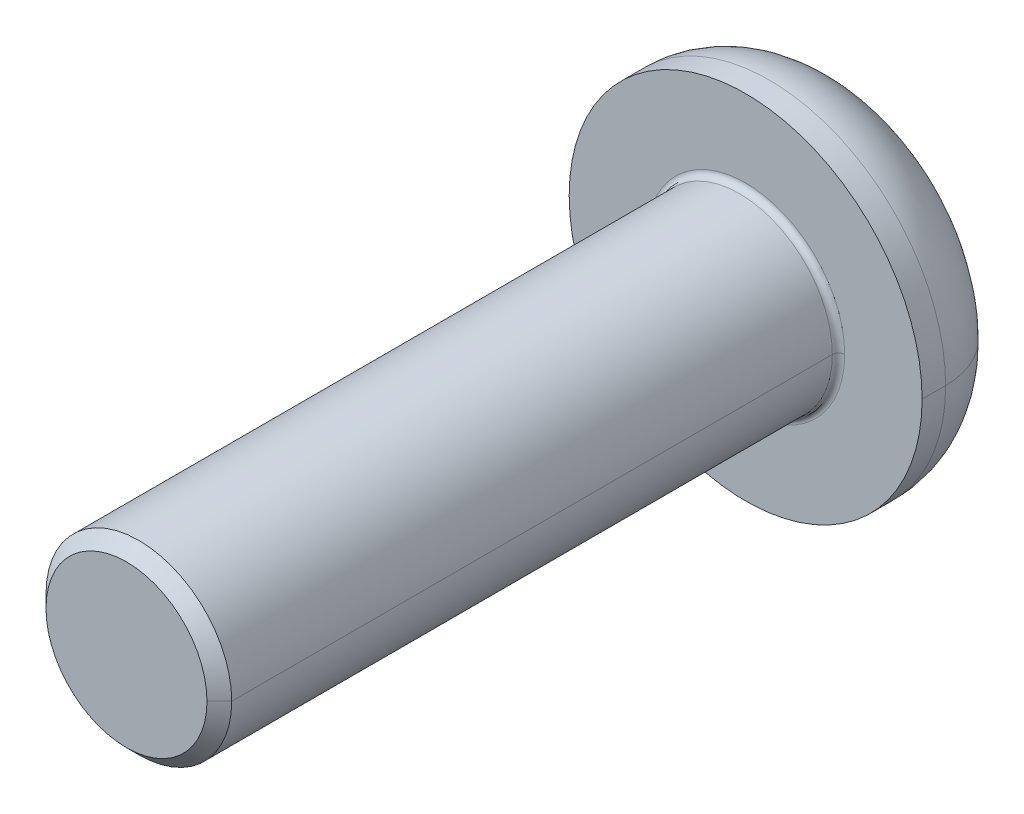
ISO-10303-21;
HEADER;
FILE_DESCRIPTION(('STEP AP214'),'2;1');
FILE_NAME('part.step','',(''),(''),'','','');
FILE_SCHEMA(('AUTOMOTIVE_DESIGN { 1 0 10303 214 1 1 1 1 }'));
ENDSEC;
DATA;
#1=APPLICATION_CONTEXT('core data for automotive mechanical design processes');
#2=APPLICATION_PROTOCOL_DEFINITION('international standard','automotive_design',2000,#1);
#3=PRODUCT_CONTEXT('',#1,'mechanical');
#4=PRODUCT('Part','Part','',(#3));
#5=PRODUCT_RELATED_PRODUCT_CATEGORY('part','',(#4));
#6=PRODUCT_DEFINITION_FORMATION('','',#4);
#7=PRODUCT_DEFINITION_CONTEXT('part definition',#1,'design');
#8=PRODUCT_DEFINITION('design','',#6,#7);
#9=PRODUCT_DEFINITION_SHAPE('','',#8);
#10=(LENGTH_UNIT() NAMED_UNIT(*) SI_UNIT(.MILLI.,.METRE.));
#11=(NAMED_UNIT(*) PLANE_ANGLE_UNIT() SI_UNIT($,.RADIAN.));
#12=(NAMED_UNIT(*) SI_UNIT($,.STERADIAN.) SOLID_ANGLE_UNIT());
#13=UNCERTAINTY_MEASURE_WITH_UNIT(LENGTH_MEASURE(1.E-05),#10,'distance_accuracy_value','');
#14=(GEOMETRIC_REPRESENTATION_CONTEXT(3) GLOBAL_UNCERTAINTY_ASSIGNED_CONTEXT((#13)) GLOBAL_UNIT_ASSIGNED_CONTEXT((#10,
#11,#12)) REPRESENTATION_CONTEXT('',''));
#15=CARTESIAN_POINT('',(0.,0.,0.));
#16=DIRECTION('',(0.,0.,1.));
#17=DIRECTION('',(1.,0.,0.));
#18=AXIS2_PLACEMENT_3D('',#15,#16,#17);
#19=CARTESIAN_POINT('',(0.,0.,0.1));
#20=DIRECTION('',(0.,0.,-1.));
#21=DIRECTION('',(-1.,0.,0.));
#22=AXIS2_PLACEMENT_3D('',#19,#20,#21);
#23=TOROIDAL_SURFACE('',#22,1.6,0.1);
#24=CARTESIAN_POINT('',(1.6,0.,0.1));
#25=DIRECTION('',(0.,1.,0.));
#26=DIRECTION('',(-1.,0.,0.));
#27=AXIS2_PLACEMENT_3D('',#24,#25,#26);
#28=CIRCLE('',#27,0.1);
#29=CARTESIAN_POINT('',(1.6,0.,0.));
#30=VERTEX_POINT('',#29);
#31=CARTESIAN_POINT('',(1.5,0.,0.1));
#32=VERTEX_POINT('',#31);
#33=EDGE_CURVE('E461',#30,#32,#28,.T.);
#34=ORIENTED_EDGE('',*,*,#33,.F.);
#35=CARTESIAN_POINT('',(0.,0.,0.));
#36=DIRECTION('',(0.,0.,-1.));
#37=DIRECTION('',(-1.,0.,0.));
#38=AXIS2_PLACEMENT_3D('',#35,#36,#37);
#39=CIRCLE('',#38,1.6);
#40=CARTESIAN_POINT('',(-1.6,0.,0.));
#41=VERTEX_POINT('',#40);
#42=EDGE_CURVE('E159',#41,#30,#39,.T.);
#43=ORIENTED_EDGE('',*,*,#42,.F.);
#44=CARTESIAN_POINT('',(-1.6,0.,0.1));
#45=DIRECTION('',(0.,-1.,0.));
#46=DIRECTION('',(0.,0.,-1.));
#47=AXIS2_PLACEMENT_3D('',#44,#45,#46);
#48=CIRCLE('',#47,0.1);
#49=CARTESIAN_POINT('',(-1.5,0.,0.1));
#50=VERTEX_POINT('',#49);
#51=EDGE_CURVE('E447',#41,#50,#48,.T.);
#52=ORIENTED_EDGE('',*,*,#51,.T.);
#53=CARTESIAN_POINT('',(0.,0.,0.1));
#54=DIRECTION('',(0.,0.,1.));
#55=DIRECTION('',(-1.,0.,0.));
#56=AXIS2_PLACEMENT_3D('',#53,#54,#55);
#57=CIRCLE('',#56,1.5);
#58=EDGE_CURVE('E341',#32,#50,#57,.T.);
#59=ORIENTED_EDGE('',*,*,#58,.F.);
#60=EDGE_LOOP('',(#34,#43,#52,#59));
#61=FACE_BOUND('',#60,.T.);
#62=ADVANCED_FACE('F17',(#61),#23,.F.);
#63=CARTESIAN_POINT('',(0.,0.,-0.38));
#64=DIRECTION('',(0.,0.,-1.));
#65=DIRECTION('',(-1.,0.,0.));
#66=AXIS2_PLACEMENT_3D('',#63,#64,#65);
#67=TOROIDAL_SURFACE('',#66,1.58,1.27);
#68=CARTESIAN_POINT('',(1.58,0.,-0.38));
#69=DIRECTION('',(0.,1.,0.));
#70=DIRECTION('',(-1.,0.,0.));
#71=AXIS2_PLACEMENT_3D('',#68,#69,#70);
#72=CIRCLE('',#71,1.27);
#73=CARTESIAN_POINT('',(2.85,0.,-0.38));
#74=VERTEX_POINT('',#73);
#75=CARTESIAN_POINT('',(1.58,0.,-1.65));
#76=VERTEX_POINT('',#75);
#77=EDGE_CURVE('E433',#74,#76,#72,.T.);
#78=ORIENTED_EDGE('',*,*,#77,.F.);
#79=CARTESIAN_POINT('',(0.,0.,-0.38));
#80=DIRECTION('',(0.,0.,1.));
#81=DIRECTION('',(-1.,0.,0.));
#82=AXIS2_PLACEMENT_3D('',#79,#80,#81);
#83=CIRCLE('',#82,2.85);
#84=CARTESIAN_POINT('',(-2.85,0.,-0.38));
#85=VERTEX_POINT('',#84);
#86=EDGE_CURVE('E310',#85,#74,#83,.T.);
#87=ORIENTED_EDGE('',*,*,#86,.F.);
#88=CARTESIAN_POINT('',(-1.58,0.,-0.38));
#89=DIRECTION('',(0.,-1.,0.));
#90=DIRECTION('',(0.,0.,-1.));
#91=AXIS2_PLACEMENT_3D('',#88,#89,#90);
#92=CIRCLE('',#91,1.27);
#93=CARTESIAN_POINT('',(-1.58,0.,-1.65));
#94=VERTEX_POINT('',#93);
#95=EDGE_CURVE('E416',#85,#94,#92,.T.);
#96=ORIENTED_EDGE('',*,*,#95,.T.);
#97=CARTESIAN_POINT('',(0.,0.,-1.65));
#98=DIRECTION('',(0.,0.,-1.));
#99=DIRECTION('',(-1.,0.,0.));
#100=AXIS2_PLACEMENT_3D('',#97,#98,#99);
#101=CIRCLE('',#100,1.58);
#102=EDGE_CURVE('E294',#76,#94,#101,.T.);
#103=ORIENTED_EDGE('',*,*,#102,.F.);
#104=EDGE_LOOP('',(#78,#87,#96,#103));
#105=FACE_BOUND('',#104,.T.);
#106=ADVANCED_FACE('F535',(#105),#67,.T.);
#107=CARTESIAN_POINT('',(0.,0.,-0.61));
#108=DIRECTION('',(0.,0.,-1.));
#109=DIRECTION('',(0.,-1.,0.));
#110=AXIS2_PLACEMENT_3D('',#107,#108,#109);
#111=PLANE('',#110);
#112=DIRECTION('',(-1.,0.,0.));
#113=VECTOR('',#112,1.);
#114=CARTESIAN_POINT('',(0.577350269189626,-1.,-0.61));
#115=LINE('',#114,#113);
#116=CARTESIAN_POINT('',(0.577350269189626,-1.,-0.61));
#117=VERTEX_POINT('',#116);
#118=CARTESIAN_POINT('',(-0.577350269189626,-1.,-0.61));
#119=VERTEX_POINT('',#118);
#120=EDGE_CURVE('E180',#117,#119,#115,.T.);
#121=ORIENTED_EDGE('',*,*,#120,.T.);
#122=DIRECTION('',(-0.5,0.866025403784439,0.));
#123=VECTOR('',#122,1.);
#124=CARTESIAN_POINT('',(-0.577350269189626,-1.,-0.61));
#125=LINE('',#124,#123);
#126=CARTESIAN_POINT('',(-1.15470053837925,0.,-0.61));
#127=VERTEX_POINT('',#126);
#128=EDGE_CURVE('E11',#119,#127,#125,.T.);
#129=ORIENTED_EDGE('',*,*,#128,.T.);
#130=DIRECTION('',(0.5,0.866025403784439,0.));
#131=VECTOR('',#130,1.);
#132=CARTESIAN_POINT('',(-1.15470053837925,0.,-0.61));
#133=LINE('',#132,#131);
#134=CARTESIAN_POINT('',(-0.577350269189626,1.,-0.61));
#135=VERTEX_POINT('',#134);
#136=EDGE_CURVE('E44',#127,#135,#133,.T.);
#137=ORIENTED_EDGE('',*,*,#136,.T.);
#138=DIRECTION('',(1.,0.,0.));
#139=VECTOR('',#138,1.);
#140=CARTESIAN_POINT('',(-0.577350269189626,1.,-0.61));
#141=LINE('',#140,#139);
#142=CARTESIAN_POINT('',(0.577350269189626,1.,-0.61));
#143=VERTEX_POINT('',#142);
#144=EDGE_CURVE('E188',#135,#143,#141,.T.);
#145=ORIENTED_EDGE('',*,*,#144,.T.);
#146=DIRECTION('',(0.5,-0.866025403784439,0.));
#147=VECTOR('',#146,1.);
#148=CARTESIAN_POINT('',(0.577350269189626,1.,-0.61));
#149=LINE('',#148,#147);
#150=CARTESIAN_POINT('',(1.15470053837925,0.,-0.61));
#151=VERTEX_POINT('',#150);
#152=EDGE_CURVE('E189',#143,#151,#149,.T.);
#153=ORIENTED_EDGE('',*,*,#152,.T.);
#154=DIRECTION('',(-0.5,-0.866025403784439,0.));
#155=VECTOR('',#154,1.);
#156=CARTESIAN_POINT('',(1.15470053837925,0.,-0.61));
#157=LINE('',#156,#155);
#158=EDGE_CURVE('E184',#151,#117,#157,.T.);
#159=ORIENTED_EDGE('',*,*,#158,.T.);
#160=EDGE_LOOP('',(#121,#129,#137,#145,#153,#159));
#161=FACE_BOUND('',#160,.T.);
#162=ADVANCED_FACE('F539',(#161),#111,.T.);
#163=CARTESIAN_POINT('',(-0.577350269189626,-1.,-0.61));
#164=DIRECTION('',(-0.866025403784439,-0.5,0.));
#165=DIRECTION('',(-0.5,0.866025403784439,0.));
#166=AXIS2_PLACEMENT_3D('',#163,#164,#165);
#167=PLANE('',#166);
#168=DIRECTION('',(-0.5,0.866025403784439,0.));
#169=VECTOR('',#168,1.);
#170=CARTESIAN_POINT('',(-0.577350269189626,-1.,-1.65));
#171=LINE('',#170,#169);
#172=CARTESIAN_POINT('',(-0.577350269189626,-1.,-1.65));
#173=VERTEX_POINT('',#172);
#174=CARTESIAN_POINT('',(-1.15470053837925,0.,-1.65));
#175=VERTEX_POINT('',#174);
#176=EDGE_CURVE('E151',#173,#175,#171,.T.);
#177=ORIENTED_EDGE('',*,*,#176,.T.);
#178=DIRECTION('',(0.,0.,-1.));
#179=VECTOR('',#178,1.);
#180=CARTESIAN_POINT('',(-1.15470053837925,0.,-0.61));
#181=LINE('',#180,#179);
#182=EDGE_CURVE('E25',#127,#175,#181,.T.);
#183=ORIENTED_EDGE('',*,*,#182,.F.);
#184=ORIENTED_EDGE('',*,*,#128,.F.);
#185=DIRECTION('',(0.,0.,-1.));
#186=VECTOR('',#185,1.);
#187=CARTESIAN_POINT('',(-0.577350269189626,-1.,-0.61));
#188=LINE('',#187,#186);
#189=EDGE_CURVE('E154',#119,#173,#188,.T.);
#190=ORIENTED_EDGE('',*,*,#189,.T.);
#191=EDGE_LOOP('',(#177,#183,#184,#190));
#192=FACE_BOUND('',#191,.T.);
#193=ADVANCED_FACE('F152',(#192),#167,.F.);
#194=CARTESIAN_POINT('',(-1.15470053837925,0.,-0.61));
#195=DIRECTION('',(-0.866025403784439,0.5,0.));
#196=DIRECTION('',(0.,0.,1.));
#197=AXIS2_PLACEMENT_3D('',#194,#195,#196);
#198=PLANE('',#197);
#199=DIRECTION('',(0.5,0.866025403784439,0.));
#200=VECTOR('',#199,1.);
#201=CARTESIAN_POINT('',(-1.15470053837925,0.,-1.65));
#202=LINE('',#201,#200);
#203=CARTESIAN_POINT('',(-0.577350269189626,1.,-1.65));
#204=VERTEX_POINT('',#203);
#205=EDGE_CURVE('E146',#175,#204,#202,.T.);
#206=ORIENTED_EDGE('',*,*,#205,.T.);
#207=DIRECTION('',(0.,0.,-1.));
#208=VECTOR('',#207,1.);
#209=CARTESIAN_POINT('',(-0.577350269189626,1.,-0.61));
#210=LINE('',#209,#208);
#211=EDGE_CURVE('E197',#135,#204,#210,.T.);
#212=ORIENTED_EDGE('',*,*,#211,.F.);
#213=ORIENTED_EDGE('',*,*,#136,.F.);
#214=ORIENTED_EDGE('',*,*,#182,.T.);
#215=EDGE_LOOP('',(#206,#212,#213,#214));
#216=FACE_BOUND('',#215,.T.);
#217=ADVANCED_FACE('F144',(#216),#198,.F.);
#218=CARTESIAN_POINT('',(-0.577350269189626,1.,-0.61));
#219=DIRECTION('',(0.,1.,0.));
#220=DIRECTION('',(1.,0.,0.));
#221=AXIS2_PLACEMENT_3D('',#218,#219,#220);
#222=PLANE('',#221);
#223=DIRECTION('',(1.,0.,0.));
#224=VECTOR('',#223,1.);
#225=CARTESIAN_POINT('',(-0.577350269189626,1.,-1.65));
#226=LINE('',#225,#224);
#227=CARTESIAN_POINT('',(0.577350269189626,1.,-1.65));
#228=VERTEX_POINT('',#227);
#229=EDGE_CURVE('E165',#204,#228,#226,.T.);
#230=ORIENTED_EDGE('',*,*,#229,.T.);
#231=DIRECTION('',(0.,0.,-1.));
#232=VECTOR('',#231,1.);
#233=CARTESIAN_POINT('',(0.577350269189626,1.,-0.61));
#234=LINE('',#233,#232);
#235=EDGE_CURVE('E185',#143,#228,#234,.T.);
#236=ORIENTED_EDGE('',*,*,#235,.F.);
#237=ORIENTED_EDGE('',*,*,#144,.F.);
#238=ORIENTED_EDGE('',*,*,#211,.T.);
#239=EDGE_LOOP('',(#230,#236,#237,#238));
#240=FACE_BOUND('',#239,.T.);
#241=ADVANCED_FACE('F553',(#240),#222,.F.);
#242=CARTESIAN_POINT('',(0.577350269189626,1.,-0.61));
#243=DIRECTION('',(0.866025403784439,0.5,0.));
#244=DIRECTION('',(0.,0.,-1.));
#245=AXIS2_PLACEMENT_3D('',#242,#243,#244);
#246=PLANE('',#245);
#247=DIRECTION('',(0.5,-0.866025403784439,0.));
#248=VECTOR('',#247,1.);
#249=CARTESIAN_POINT('',(0.577350269189626,1.,-1.65));
#250=LINE('',#249,#248);
#251=CARTESIAN_POINT('',(1.15470053837925,0.,-1.65));
#252=VERTEX_POINT('',#251);
#253=EDGE_CURVE('E172',#228,#252,#250,.T.);
#254=ORIENTED_EDGE('',*,*,#253,.T.);
#255=DIRECTION('',(0.,0.,-1.));
#256=VECTOR('',#255,1.);
#257=CARTESIAN_POINT('',(1.15470053837925,0.,-0.61));
#258=LINE('',#257,#256);
#259=EDGE_CURVE('E192',#151,#252,#258,.T.);
#260=ORIENTED_EDGE('',*,*,#259,.F.);
#261=ORIENTED_EDGE('',*,*,#152,.F.);
#262=ORIENTED_EDGE('',*,*,#235,.T.);
#263=EDGE_LOOP('',(#254,#260,#261,#262));
#264=FACE_BOUND('',#263,.T.);
#265=ADVANCED_FACE('F549',(#264),#246,.F.);
#266=CARTESIAN_POINT('',(1.15470053837925,0.,-0.61));
#267=DIRECTION('',(0.866025403784439,-0.5,0.));
#268=DIRECTION('',(0.,0.,-1.));
#269=AXIS2_PLACEMENT_3D('',#266,#267,#268);
#270=PLANE('',#269);
#271=DIRECTION('',(-0.5,-0.866025403784439,0.));
#272=VECTOR('',#271,1.);
#273=CARTESIAN_POINT('',(1.15470053837925,0.,-1.65));
#274=LINE('',#273,#272);
#275=CARTESIAN_POINT('',(0.577350269189626,-1.,-1.65));
#276=VERTEX_POINT('',#275);
#277=EDGE_CURVE('E278',#252,#276,#274,.T.);
#278=ORIENTED_EDGE('',*,*,#277,.T.);
#279=DIRECTION('',(0.,0.,-1.));
#280=VECTOR('',#279,1.);
#281=CARTESIAN_POINT('',(0.577350269189626,-1.,-0.61));
#282=LINE('',#281,#280);
#283=EDGE_CURVE('E181',#117,#276,#282,.T.);
#284=ORIENTED_EDGE('',*,*,#283,.F.);
#285=ORIENTED_EDGE('',*,*,#158,.F.);
#286=ORIENTED_EDGE('',*,*,#259,.T.);
#287=EDGE_LOOP('',(#278,#284,#285,#286));
#288=FACE_BOUND('',#287,.T.);
#289=ADVANCED_FACE('F552',(#288),#270,.F.);
#290=CARTESIAN_POINT('',(0.577350269189626,-1.,-0.61));
#291=DIRECTION('',(0.,-1.,0.));
#292=DIRECTION('',(-1.,0.,0.));
#293=AXIS2_PLACEMENT_3D('',#290,#291,#292);
#294=PLANE('',#293);
#295=DIRECTION('',(-1.,0.,0.));
#296=VECTOR('',#295,1.);
#297=CARTESIAN_POINT('',(0.577350269189626,-1.,-1.65));
#298=LINE('',#297,#296);
#299=EDGE_CURVE('E286',#276,#173,#298,.T.);
#300=ORIENTED_EDGE('',*,*,#299,.T.);
#301=ORIENTED_EDGE('',*,*,#189,.F.);
#302=ORIENTED_EDGE('',*,*,#120,.F.);
#303=ORIENTED_EDGE('',*,*,#283,.T.);
#304=EDGE_LOOP('',(#300,#301,#302,#303));
#305=FACE_BOUND('',#304,.T.);
#306=ADVANCED_FACE('F555',(#305),#294,.F.);
#307=CARTESIAN_POINT('',(0.,0.,0.));
#308=DIRECTION('',(0.,0.,-1.));
#309=DIRECTION('',(0.,-1.,0.));
#310=AXIS2_PLACEMENT_3D('',#307,#308,#309);
#311=PLANE('',#310);
#312=ORIENTED_EDGE('',*,*,#42,.T.);
#313=CARTESIAN_POINT('',(0.,0.,0.));
#314=DIRECTION('',(0.,0.,-1.));
#315=DIRECTION('',(-1.,0.,0.));
#316=AXIS2_PLACEMENT_3D('',#313,#314,#315);
#317=CIRCLE('',#316,1.6);
#318=EDGE_CURVE('E468',#30,#41,#317,.T.);
#319=ORIENTED_EDGE('',*,*,#318,.T.);
#320=EDGE_LOOP('',(#312,#319));
#321=FACE_BOUND('',#320,.T.);
#322=CARTESIAN_POINT('',(0.,0.,0.));
#323=DIRECTION('',(0.,0.,-1.));
#324=DIRECTION('',(-1.,0.,0.));
#325=AXIS2_PLACEMENT_3D('',#322,#323,#324);
#326=CIRCLE('',#325,2.85);
#327=CARTESIAN_POINT('',(2.85,0.,0.));
#328=VERTEX_POINT('',#327);
#329=CARTESIAN_POINT('',(-2.85,0.,0.));
#330=VERTEX_POINT('',#329);
#331=EDGE_CURVE('E302',#328,#330,#326,.T.);
#332=ORIENTED_EDGE('',*,*,#331,.F.);
#333=CARTESIAN_POINT('',(0.,0.,0.));
#334=DIRECTION('',(0.,0.,-1.));
#335=DIRECTION('',(-1.,0.,0.));
#336=AXIS2_PLACEMENT_3D('',#333,#334,#335);
#337=CIRCLE('',#336,2.85);
#338=EDGE_CURVE('E399',#330,#328,#337,.T.);
#339=ORIENTED_EDGE('',*,*,#338,.F.);
#340=EDGE_LOOP('',(#332,#339));
#341=FACE_BOUND('',#340,.T.);
#342=ADVANCED_FACE('F499',(#321,#341),#311,.F.);
#343=CARTESIAN_POINT('',(0.,0.,-1.65));
#344=DIRECTION('',(0.,0.,-1.));
#345=DIRECTION('',(0.,-1.,0.));
#346=AXIS2_PLACEMENT_3D('',#343,#344,#345);
#347=PLANE('',#346);
#348=ORIENTED_EDGE('',*,*,#299,.F.);
#349=ORIENTED_EDGE('',*,*,#277,.F.);
#350=ORIENTED_EDGE('',*,*,#253,.F.);
#351=ORIENTED_EDGE('',*,*,#229,.F.);
#352=ORIENTED_EDGE('',*,*,#205,.F.);
#353=ORIENTED_EDGE('',*,*,#176,.F.);
#354=EDGE_LOOP('',(#348,#349,#350,#351,#352,#353));
#355=FACE_BOUND('',#354,.T.);
#356=CARTESIAN_POINT('',(0.,0.,-1.65));
#357=DIRECTION('',(0.,0.,-1.));
#358=DIRECTION('',(-1.,0.,0.));
#359=AXIS2_PLACEMENT_3D('',#356,#357,#358);
#360=CIRCLE('',#359,1.58);
#361=EDGE_CURVE('E425',#94,#76,#360,.T.);
#362=ORIENTED_EDGE('',*,*,#361,.T.);
#363=ORIENTED_EDGE('',*,*,#102,.T.);
#364=EDGE_LOOP('',(#362,#363));
#365=FACE_BOUND('',#364,.T.);
#366=ADVANCED_FACE('F161',(#355,#365),#347,.T.);
#367=CARTESIAN_POINT('',(0.,0.,-1.65));
#368=DIRECTION('',(0.,0.,1.));
#369=DIRECTION('',(1.,0.,0.));
#370=AXIS2_PLACEMENT_3D('',#367,#368,#369);
#371=CYLINDRICAL_SURFACE('',#370,2.85);
#372=DIRECTION('',(0.,0.,1.));
#373=VECTOR('',#372,1.);
#374=CARTESIAN_POINT('',(-2.85,0.,-1.65));
#375=LINE('',#374,#373);
#376=EDGE_CURVE('E408',#85,#330,#375,.T.);
#377=ORIENTED_EDGE('',*,*,#376,.F.);
#378=ORIENTED_EDGE('',*,*,#86,.T.);
#379=DIRECTION('',(0.,0.,1.));
#380=VECTOR('',#379,1.);
#381=CARTESIAN_POINT('',(2.85,0.,-1.65));
#382=LINE('',#381,#380);
#383=EDGE_CURVE('E392',#74,#328,#382,.T.);
#384=ORIENTED_EDGE('',*,*,#383,.T.);
#385=ORIENTED_EDGE('',*,*,#331,.T.);
#386=EDGE_LOOP('',(#377,#378,#384,#385));
#387=FACE_BOUND('',#386,.T.);
#388=ADVANCED_FACE('F531',(#387),#371,.T.);
#389=CARTESIAN_POINT('',(0.,0.,10.));
#390=DIRECTION('',(0.,0.,-1.));
#391=DIRECTION('',(-1.,0.,0.));
#392=AXIS2_PLACEMENT_3D('',#389,#390,#391);
#393=CONICAL_SURFACE('',#392,1.3,0.78539816339745);
#394=DIRECTION('',(0.707106781186549,0.,-0.707106781186546));
#395=VECTOR('',#394,1.);
#396=CARTESIAN_POINT('',(1.3,0.,10.));
#397=LINE('',#396,#395);
#398=CARTESIAN_POINT('',(1.3,0.,10.));
#399=VERTEX_POINT('',#398);
#400=CARTESIAN_POINT('',(1.5,0.,9.8));
#401=VERTEX_POINT('',#400);
#402=EDGE_CURVE('E376',#399,#401,#397,.T.);
#403=ORIENTED_EDGE('',*,*,#402,.F.);
#404=CARTESIAN_POINT('',(0.,0.,10.));
#405=DIRECTION('',(0.,0.,1.));
#406=DIRECTION('',(1.,0.,0.));
#407=AXIS2_PLACEMENT_3D('',#404,#405,#406);
#408=CIRCLE('',#407,1.3);
#409=CARTESIAN_POINT('',(-1.3,0.,10.));
#410=VERTEX_POINT('',#409);
#411=EDGE_CURVE('E318',#410,#399,#408,.T.);
#412=ORIENTED_EDGE('',*,*,#411,.F.);
#413=DIRECTION('',(-0.707106781186549,0.,-0.707106781186546));
#414=VECTOR('',#413,1.);
#415=CARTESIAN_POINT('',(-1.3,0.,10.));
#416=LINE('',#415,#414);
#417=CARTESIAN_POINT('',(-1.5,0.,9.8));
#418=VERTEX_POINT('',#417);
#419=EDGE_CURVE('E358',#410,#418,#416,.T.);
#420=ORIENTED_EDGE('',*,*,#419,.T.);
#421=CARTESIAN_POINT('',(0.,0.,9.8));
#422=DIRECTION('',(0.,0.,-1.));
#423=DIRECTION('',(1.,0.,0.));
#424=AXIS2_PLACEMENT_3D('',#421,#422,#423);
#425=CIRCLE('',#424,1.5);
#426=EDGE_CURVE('E326',#401,#418,#425,.T.);
#427=ORIENTED_EDGE('',*,*,#426,.F.);
#428=EDGE_LOOP('',(#403,#412,#420,#427));
#429=FACE_BOUND('',#428,.T.);
#430=ADVANCED_FACE('F517',(#429),#393,.T.);
#431=CARTESIAN_POINT('',(0.,0.,10.));
#432=DIRECTION('',(0.,0.,1.));
#433=DIRECTION('',(1.,0.,0.));
#434=AXIS2_PLACEMENT_3D('',#431,#432,#433);
#435=PLANE('',#434);
#436=ORIENTED_EDGE('',*,*,#411,.T.);
#437=CARTESIAN_POINT('',(0.,0.,10.));
#438=DIRECTION('',(0.,0.,1.));
#439=DIRECTION('',(1.,0.,0.));
#440=AXIS2_PLACEMENT_3D('',#437,#438,#439);
#441=CIRCLE('',#440,1.3);
#442=EDGE_CURVE('E385',#399,#410,#441,.T.);
#443=ORIENTED_EDGE('',*,*,#442,.T.);
#444=EDGE_LOOP('',(#436,#443));
#445=FACE_BOUND('',#444,.T.);
#446=ADVANCED_FACE('F522',(#445),#435,.T.);
#447=CARTESIAN_POINT('',(0.,0.,10.));
#448=DIRECTION('',(0.,0.,-1.));
#449=DIRECTION('',(-1.,0.,0.));
#450=AXIS2_PLACEMENT_3D('',#447,#448,#449);
#451=CYLINDRICAL_SURFACE('',#450,1.5);
#452=DIRECTION('',(0.,0.,-1.));
#453=VECTOR('',#452,1.);
#454=CARTESIAN_POINT('',(1.5,0.,10.));
#455=LINE('',#454,#453);
#456=EDGE_CURVE('E349',#401,#32,#455,.T.);
#457=ORIENTED_EDGE('',*,*,#456,.F.);
#458=ORIENTED_EDGE('',*,*,#426,.T.);
#459=DIRECTION('',(0.,0.,-1.));
#460=VECTOR('',#459,1.);
#461=CARTESIAN_POINT('',(-1.5,0.,10.));
#462=LINE('',#461,#460);
#463=EDGE_CURVE('E334',#418,#50,#462,.T.);
#464=ORIENTED_EDGE('',*,*,#463,.T.);
#465=CARTESIAN_POINT('',(0.,0.,0.1));
#466=DIRECTION('',(0.,0.,1.));
#467=DIRECTION('',(-1.,0.,0.));
#468=AXIS2_PLACEMENT_3D('',#465,#466,#467);
#469=CIRCLE('',#468,1.5);
#470=EDGE_CURVE('E454',#50,#32,#469,.T.);
#471=ORIENTED_EDGE('',*,*,#470,.T.);
#472=EDGE_LOOP('',(#457,#458,#464,#471));
#473=FACE_BOUND('',#472,.T.);
#474=ADVANCED_FACE('F513',(#473),#451,.T.);
#475=CARTESIAN_POINT('',(0.,0.,10.));
#476=DIRECTION('',(0.,0.,-1.));
#477=DIRECTION('',(-1.,0.,0.));
#478=AXIS2_PLACEMENT_3D('',#475,#476,#477);
#479=CYLINDRICAL_SURFACE('',#478,1.5);
#480=CARTESIAN_POINT('',(0.,0.,9.8));
#481=DIRECTION('',(0.,0.,-1.));
#482=DIRECTION('',(1.,0.,0.));
#483=AXIS2_PLACEMENT_3D('',#480,#481,#482);
#484=CIRCLE('',#483,1.5);
#485=EDGE_CURVE('E367',#418,#401,#484,.T.);
#486=ORIENTED_EDGE('',*,*,#485,.T.);
#487=ORIENTED_EDGE('',*,*,#456,.T.);
#488=ORIENTED_EDGE('',*,*,#58,.T.);
#489=ORIENTED_EDGE('',*,*,#463,.F.);
#490=EDGE_LOOP('',(#486,#487,#488,#489));
#491=FACE_BOUND('',#490,.T.);
#492=ADVANCED_FACE('F510',(#491),#479,.T.);
#493=CARTESIAN_POINT('',(0.,0.,10.));
#494=DIRECTION('',(0.,0.,-1.));
#495=DIRECTION('',(-1.,0.,0.));
#496=AXIS2_PLACEMENT_3D('',#493,#494,#495);
#497=CONICAL_SURFACE('',#496,1.3,0.78539816339745);
#498=ORIENTED_EDGE('',*,*,#442,.F.);
#499=ORIENTED_EDGE('',*,*,#402,.T.);
#500=ORIENTED_EDGE('',*,*,#485,.F.);
#501=ORIENTED_EDGE('',*,*,#419,.F.);
#502=EDGE_LOOP('',(#498,#499,#500,#501));
#503=FACE_BOUND('',#502,.T.);
#504=ADVANCED_FACE('F520',(#503),#497,.T.);
#505=CARTESIAN_POINT('',(0.,0.,-1.65));
#506=DIRECTION('',(0.,0.,1.));
#507=DIRECTION('',(1.,0.,0.));
#508=AXIS2_PLACEMENT_3D('',#505,#506,#507);
#509=CYLINDRICAL_SURFACE('',#508,2.85);
#510=CARTESIAN_POINT('',(0.,0.,-0.38));
#511=DIRECTION('',(0.,0.,1.));
#512=DIRECTION('',(-1.,0.,0.));
#513=AXIS2_PLACEMENT_3D('',#510,#511,#512);
#514=CIRCLE('',#513,2.85);
#515=EDGE_CURVE('E440',#74,#85,#514,.T.);
#516=ORIENTED_EDGE('',*,*,#515,.T.);
#517=ORIENTED_EDGE('',*,*,#376,.T.);
#518=ORIENTED_EDGE('',*,*,#338,.T.);
#519=ORIENTED_EDGE('',*,*,#383,.F.);
#520=EDGE_LOOP('',(#516,#517,#518,#519));
#521=FACE_BOUND('',#520,.T.);
#522=ADVANCED_FACE('F593',(#521),#509,.T.);
#523=CARTESIAN_POINT('',(0.,0.,-0.38));
#524=DIRECTION('',(0.,0.,-1.));
#525=DIRECTION('',(-1.,0.,0.));
#526=AXIS2_PLACEMENT_3D('',#523,#524,#525);
#527=TOROIDAL_SURFACE('',#526,1.58,1.27);
#528=ORIENTED_EDGE('',*,*,#515,.F.);
#529=ORIENTED_EDGE('',*,*,#77,.T.);
#530=ORIENTED_EDGE('',*,*,#361,.F.);
#531=ORIENTED_EDGE('',*,*,#95,.F.);
#532=EDGE_LOOP('',(#528,#529,#530,#531));
#533=FACE_BOUND('',#532,.T.);
#534=ADVANCED_FACE('F595',(#533),#527,.T.);
#535=CARTESIAN_POINT('',(0.,0.,0.1));
#536=DIRECTION('',(0.,0.,-1.));
#537=DIRECTION('',(-1.,0.,0.));
#538=AXIS2_PLACEMENT_3D('',#535,#536,#537);
#539=TOROIDAL_SURFACE('',#538,1.6,0.1);
#540=ORIENTED_EDGE('',*,*,#318,.F.);
#541=ORIENTED_EDGE('',*,*,#33,.T.);
#542=ORIENTED_EDGE('',*,*,#470,.F.);
#543=ORIENTED_EDGE('',*,*,#51,.F.);
#544=EDGE_LOOP('',(#540,#541,#542,#543));
#545=FACE_BOUND('',#544,.T.);
#546=ADVANCED_FACE('F504',(#545),#539,.F.);
#547=CLOSED_SHELL('',(#62,#106,#162,#193,#217,#241,#265,#289,#306,#342,#366,#388,#430,#446,#474,
#492,#504,#522,#534,#546));
#548=MANIFOLD_SOLID_BREP('B1',#547);
#549=ADVANCED_BREP_SHAPE_REPRESENTATION('',(#18,#548),#14);
#550=SHAPE_DEFINITION_REPRESENTATION(#9,#549);
ENDSEC;
END-ISO-10303-21;
